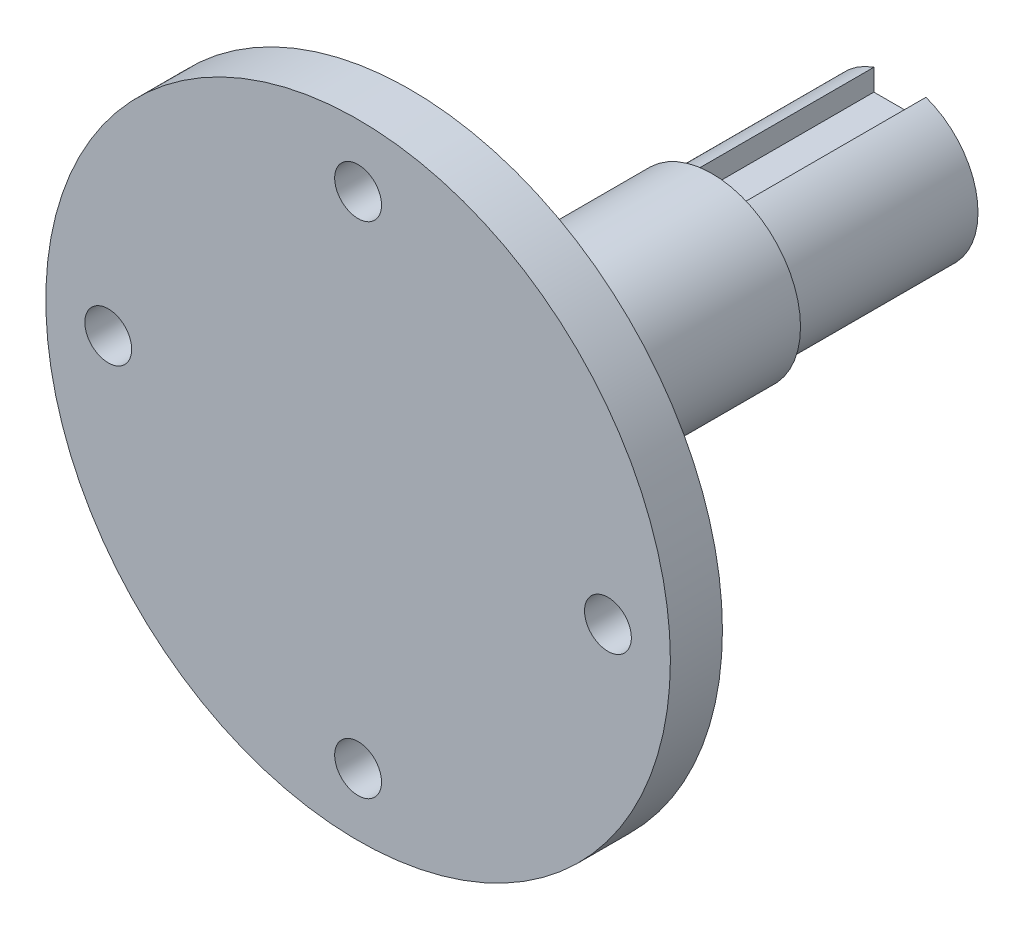
ISO-10303-21;
HEADER;
FILE_DESCRIPTION(('STEP AP214'),'2;1');
FILE_NAME('part.step','',(''),(''),'','','');
FILE_SCHEMA(('AUTOMOTIVE_DESIGN { 1 0 10303 214 1 1 1 1 }'));
ENDSEC;
DATA;
#1=APPLICATION_CONTEXT('core data for automotive mechanical design processes');
#2=APPLICATION_PROTOCOL_DEFINITION('international standard','automotive_design',2000,#1);
#3=PRODUCT_CONTEXT('',#1,'mechanical');
#4=PRODUCT('Part','Part','',(#3));
#5=PRODUCT_RELATED_PRODUCT_CATEGORY('part','',(#4));
#6=PRODUCT_DEFINITION_FORMATION('','',#4);
#7=PRODUCT_DEFINITION_CONTEXT('part definition',#1,'design');
#8=PRODUCT_DEFINITION('design','',#6,#7);
#9=PRODUCT_DEFINITION_SHAPE('','',#8);
#10=(LENGTH_UNIT() NAMED_UNIT(*) SI_UNIT(.MILLI.,.METRE.));
#11=(NAMED_UNIT(*) PLANE_ANGLE_UNIT() SI_UNIT($,.RADIAN.));
#12=(NAMED_UNIT(*) SI_UNIT($,.STERADIAN.) SOLID_ANGLE_UNIT());
#13=UNCERTAINTY_MEASURE_WITH_UNIT(LENGTH_MEASURE(1.E-05),#10,'distance_accuracy_value','');
#14=(GEOMETRIC_REPRESENTATION_CONTEXT(3) GLOBAL_UNCERTAINTY_ASSIGNED_CONTEXT((#13)) GLOBAL_UNIT_ASSIGNED_CONTEXT((#10,
#11,#12)) REPRESENTATION_CONTEXT('',''));
#15=CARTESIAN_POINT('',(0.,0.,0.));
#16=DIRECTION('',(0.,0.,1.));
#17=DIRECTION('',(1.,0.,0.));
#18=AXIS2_PLACEMENT_3D('',#15,#16,#17);
#19=CARTESIAN_POINT('',(0.,0.,20.05));
#20=DIRECTION('',(0.,0.,-1.));
#21=DIRECTION('',(-1.,0.,0.));
#22=AXIS2_PLACEMENT_3D('',#19,#20,#21);
#23=CYLINDRICAL_SURFACE('',#22,7.5);
#24=CARTESIAN_POINT('',(0.,0.,2.));
#25=DIRECTION('',(0.,0.,-1.));
#26=DIRECTION('',(-1.,0.,0.));
#27=AXIS2_PLACEMENT_3D('',#24,#25,#26);
#28=CIRCLE('',#27,7.5);
#29=CARTESIAN_POINT('',(2.5,7.07106781186548,2.));
#30=VERTEX_POINT('',#29);
#31=CARTESIAN_POINT('',(-2.5,7.07106781186548,2.));
#32=VERTEX_POINT('',#31);
#33=EDGE_CURVE('E85',#30,#32,#28,.T.);
#34=ORIENTED_EDGE('',*,*,#33,.F.);
#35=DIRECTION('',(0.,0.,-1.));
#36=VECTOR('',#35,1.);
#37=CARTESIAN_POINT('',(2.5,7.07106781186547,20.05));
#38=LINE('',#37,#36);
#39=CARTESIAN_POINT('',(2.5,7.07106781186548,20.05));
#40=VERTEX_POINT('',#39);
#41=EDGE_CURVE('E177',#30,#40,#38,.F.);
#42=ORIENTED_EDGE('',*,*,#41,.T.);
#43=CARTESIAN_POINT('',(0.,0.,20.05));
#44=DIRECTION('',(0.,0.,1.));
#45=DIRECTION('',(1.,0.,0.));
#46=AXIS2_PLACEMENT_3D('',#43,#44,#45);
#47=CIRCLE('',#46,7.5);
#48=CARTESIAN_POINT('',(-2.5,7.07106781186548,20.05));
#49=VERTEX_POINT('',#48);
#50=EDGE_CURVE('E107',#49,#40,#47,.T.);
#51=ORIENTED_EDGE('',*,*,#50,.F.);
#52=DIRECTION('',(0.,0.,-1.));
#53=VECTOR('',#52,1.);
#54=CARTESIAN_POINT('',(-2.5,7.07106781186548,20.05));
#55=LINE('',#54,#53);
#56=EDGE_CURVE('E100',#49,#32,#55,.T.);
#57=ORIENTED_EDGE('',*,*,#56,.T.);
#58=EDGE_LOOP('',(#34,#42,#51,#57));
#59=FACE_BOUND('',#58,.T.);
#60=ADVANCED_FACE('F42',(#59),#23,.T.);
#61=CARTESIAN_POINT('',(-2.5,5.,21.));
#62=DIRECTION('',(-1.,0.,0.));
#63=DIRECTION('',(0.,0.,1.));
#64=AXIS2_PLACEMENT_3D('',#61,#62,#63);
#65=PLANE('',#64);
#66=DIRECTION('',(0.,-1.,0.));
#67=VECTOR('',#66,1.);
#68=CARTESIAN_POINT('',(-2.5,5.,2.));
#69=LINE('',#68,#67);
#70=CARTESIAN_POINT('',(-2.5,5.,2.00000000000001));
#71=VERTEX_POINT('',#70);
#72=EDGE_CURVE('E60',#32,#71,#69,.T.);
#73=ORIENTED_EDGE('',*,*,#72,.F.);
#74=ORIENTED_EDGE('',*,*,#56,.F.);
#75=DIRECTION('',(0.,-1.,0.));
#76=VECTOR('',#75,1.);
#77=CARTESIAN_POINT('',(-2.5,0.,20.05));
#78=LINE('',#77,#76);
#79=CARTESIAN_POINT('',(-2.5,5.,20.05));
#80=VERTEX_POINT('',#79);
#81=EDGE_CURVE('E109',#49,#80,#78,.T.);
#82=ORIENTED_EDGE('',*,*,#81,.T.);
#83=DIRECTION('',(0.,0.,-1.));
#84=VECTOR('',#83,1.);
#85=CARTESIAN_POINT('',(-2.5,5.,21.));
#86=LINE('',#85,#84);
#87=EDGE_CURVE('E103',#80,#71,#86,.T.);
#88=ORIENTED_EDGE('',*,*,#87,.T.);
#89=EDGE_LOOP('',(#73,#74,#82,#88));
#90=FACE_BOUND('',#89,.T.);
#91=ADVANCED_FACE('F98',(#90),#65,.F.);
#92=CARTESIAN_POINT('',(2.5,5.,21.));
#93=DIRECTION('',(1.,0.,0.));
#94=DIRECTION('',(0.,0.,-1.));
#95=AXIS2_PLACEMENT_3D('',#92,#93,#94);
#96=PLANE('',#95);
#97=DIRECTION('',(0.,1.,0.));
#98=VECTOR('',#97,1.);
#99=CARTESIAN_POINT('',(2.5,5.,2.));
#100=LINE('',#99,#98);
#101=CARTESIAN_POINT('',(2.5,5.,2.));
#102=VERTEX_POINT('',#101);
#103=EDGE_CURVE('E88',#102,#30,#100,.T.);
#104=ORIENTED_EDGE('',*,*,#103,.F.);
#105=DIRECTION('',(0.,0.,-1.));
#106=VECTOR('',#105,1.);
#107=CARTESIAN_POINT('',(2.5,5.,21.));
#108=LINE('',#107,#106);
#109=CARTESIAN_POINT('',(2.5,5.,20.05));
#110=VERTEX_POINT('',#109);
#111=EDGE_CURVE('E171',#110,#102,#108,.T.);
#112=ORIENTED_EDGE('',*,*,#111,.F.);
#113=DIRECTION('',(0.,1.,0.));
#114=VECTOR('',#113,1.);
#115=CARTESIAN_POINT('',(2.5,0.,20.05));
#116=LINE('',#115,#114);
#117=EDGE_CURVE('E68',#110,#40,#116,.T.);
#118=ORIENTED_EDGE('',*,*,#117,.T.);
#119=ORIENTED_EDGE('',*,*,#41,.F.);
#120=EDGE_LOOP('',(#104,#112,#118,#119));
#121=FACE_BOUND('',#120,.T.);
#122=ADVANCED_FACE('F184',(#121),#96,.F.);
#123=CARTESIAN_POINT('',(2.5,5.,21.));
#124=DIRECTION('',(0.,-1.,0.));
#125=DIRECTION('',(0.,0.,-1.));
#126=AXIS2_PLACEMENT_3D('',#123,#124,#125);
#127=PLANE('',#126);
#128=DIRECTION('',(1.,0.,0.));
#129=VECTOR('',#128,1.);
#130=CARTESIAN_POINT('',(2.5,5.,2.));
#131=LINE('',#130,#129);
#132=EDGE_CURVE('E186',#71,#102,#131,.T.);
#133=ORIENTED_EDGE('',*,*,#132,.F.);
#134=ORIENTED_EDGE('',*,*,#87,.F.);
#135=DIRECTION('',(1.,0.,0.));
#136=VECTOR('',#135,1.);
#137=CARTESIAN_POINT('',(0.,5.,20.05));
#138=LINE('',#137,#136);
#139=EDGE_CURVE('E117',#80,#110,#138,.T.);
#140=ORIENTED_EDGE('',*,*,#139,.T.);
#141=ORIENTED_EDGE('',*,*,#111,.T.);
#142=EDGE_LOOP('',(#133,#134,#140,#141));
#143=FACE_BOUND('',#142,.T.);
#144=ADVANCED_FACE('F182',(#143),#127,.F.);
#145=CARTESIAN_POINT('',(0.,0.,44.05));
#146=DIRECTION('',(0.,0.,-1.));
#147=DIRECTION('',(-1.,0.,0.));
#148=AXIS2_PLACEMENT_3D('',#145,#146,#147);
#149=CYLINDRICAL_SURFACE('',#148,8.5);
#150=CARTESIAN_POINT('',(0.,0.,43.45));
#151=DIRECTION('',(0.,0.,1.));
#152=DIRECTION('',(1.,0.,0.));
#153=AXIS2_PLACEMENT_3D('',#150,#151,#152);
#154=CIRCLE('',#153,8.5);
#155=CARTESIAN_POINT('',(8.5,0.,43.45));
#156=VERTEX_POINT('',#155);
#157=EDGE_CURVE('E52',#156,#156,#154,.F.);
#158=ORIENTED_EDGE('',*,*,#157,.T.);
#159=EDGE_LOOP('',(#158));
#160=FACE_BOUND('',#159,.T.);
#161=CARTESIAN_POINT('',(0.,0.,20.05));
#162=DIRECTION('',(0.,0.,1.));
#163=DIRECTION('',(1.,0.,0.));
#164=AXIS2_PLACEMENT_3D('',#161,#162,#163);
#165=CIRCLE('',#164,8.5);
#166=CARTESIAN_POINT('',(8.5,0.,20.05));
#167=VERTEX_POINT('',#166);
#168=EDGE_CURVE('E167',#167,#167,#165,.T.);
#169=ORIENTED_EDGE('',*,*,#168,.T.);
#170=EDGE_LOOP('',(#169));
#171=FACE_BOUND('',#170,.T.);
#172=ADVANCED_FACE('F244',(#160,#171),#149,.T.);
#173=CARTESIAN_POINT('',(0.,0.,20.05));
#174=DIRECTION('',(0.,0.,1.));
#175=DIRECTION('',(1.,0.,0.));
#176=AXIS2_PLACEMENT_3D('',#173,#174,#175);
#177=PLANE('',#176);
#178=ORIENTED_EDGE('',*,*,#81,.F.);
#179=ORIENTED_EDGE('',*,*,#50,.T.);
#180=ORIENTED_EDGE('',*,*,#117,.F.);
#181=ORIENTED_EDGE('',*,*,#139,.F.);
#182=EDGE_LOOP('',(#178,#179,#180,#181));
#183=FACE_BOUND('',#182,.T.);
#184=ORIENTED_EDGE('',*,*,#168,.F.);
#185=EDGE_LOOP('',(#184));
#186=FACE_BOUND('',#185,.T.);
#187=ADVANCED_FACE('F247',(#183,#186),#177,.F.);
#188=CARTESIAN_POINT('',(0.,0.,44.05));
#189=DIRECTION('',(0.,0.,1.));
#190=DIRECTION('',(1.,0.,0.));
#191=AXIS2_PLACEMENT_3D('',#188,#189,#190);
#192=PLANE('',#191);
#193=CARTESIAN_POINT('',(0.,0.,44.05));
#194=DIRECTION('',(0.,0.,1.));
#195=DIRECTION('',(1.,0.,0.));
#196=AXIS2_PLACEMENT_3D('',#193,#194,#195);
#197=CIRCLE('',#196,9.1);
#198=CARTESIAN_POINT('',(9.1,0.,44.05));
#199=VERTEX_POINT('',#198);
#200=EDGE_CURVE('E114',#199,#199,#197,.T.);
#201=ORIENTED_EDGE('',*,*,#200,.T.);
#202=EDGE_LOOP('',(#201));
#203=FACE_BOUND('',#202,.T.);
#204=CARTESIAN_POINT('',(0.,0.,44.05));
#205=DIRECTION('',(0.,0.,1.));
#206=DIRECTION('',(1.,0.,0.));
#207=AXIS2_PLACEMENT_3D('',#204,#205,#206);
#208=CIRCLE('',#207,11.25);
#209=CARTESIAN_POINT('',(11.25,0.,44.05));
#210=VERTEX_POINT('',#209);
#211=EDGE_CURVE('E160',#210,#210,#208,.T.);
#212=ORIENTED_EDGE('',*,*,#211,.F.);
#213=EDGE_LOOP('',(#212));
#214=FACE_BOUND('',#213,.T.);
#215=ADVANCED_FACE('F220',(#203,#214),#192,.F.);
#216=CARTESIAN_POINT('',(0.,0.,54.05));
#217=DIRECTION('',(0.,0.,-1.));
#218=DIRECTION('',(-1.,0.,0.));
#219=AXIS2_PLACEMENT_3D('',#216,#217,#218);
#220=CYLINDRICAL_SURFACE('',#219,30.);
#221=CARTESIAN_POINT('',(0.,0.,54.05));
#222=DIRECTION('',(0.,0.,1.));
#223=DIRECTION('',(1.,0.,0.));
#224=AXIS2_PLACEMENT_3D('',#221,#222,#223);
#225=CIRCLE('',#224,30.);
#226=CARTESIAN_POINT('',(30.,0.,54.05));
#227=VERTEX_POINT('',#226);
#228=EDGE_CURVE('E156',#227,#227,#225,.T.);
#229=ORIENTED_EDGE('',*,*,#228,.F.);
#230=EDGE_LOOP('',(#229));
#231=FACE_BOUND('',#230,.T.);
#232=CARTESIAN_POINT('',(0.,0.,49.05));
#233=DIRECTION('',(0.,0.,1.));
#234=DIRECTION('',(1.,0.,0.));
#235=AXIS2_PLACEMENT_3D('',#232,#233,#234);
#236=CIRCLE('',#235,30.);
#237=CARTESIAN_POINT('',(30.,0.,49.05));
#238=VERTEX_POINT('',#237);
#239=EDGE_CURVE('E155',#238,#238,#236,.T.);
#240=ORIENTED_EDGE('',*,*,#239,.T.);
#241=EDGE_LOOP('',(#240));
#242=FACE_BOUND('',#241,.T.);
#243=ADVANCED_FACE('F210',(#231,#242),#220,.T.);
#244=CARTESIAN_POINT('',(0.,0.,54.05));
#245=DIRECTION('',(0.,0.,1.));
#246=DIRECTION('',(1.,0.,0.));
#247=AXIS2_PLACEMENT_3D('',#244,#245,#246);
#248=PLANE('',#247);
#249=CARTESIAN_POINT('',(0.,24.,54.05));
#250=DIRECTION('',(0.,0.,1.));
#251=DIRECTION('',(1.,0.,0.));
#252=AXIS2_PLACEMENT_3D('',#249,#250,#251);
#253=CIRCLE('',#252,2.24999999999999);
#254=CARTESIAN_POINT('',(2.24999999999999,24.,54.05));
#255=VERTEX_POINT('',#254);
#256=EDGE_CURVE('E193',#255,#255,#253,.T.);
#257=ORIENTED_EDGE('',*,*,#256,.F.);
#258=EDGE_LOOP('',(#257));
#259=FACE_BOUND('',#258,.T.);
#260=CARTESIAN_POINT('',(0.,-24.,54.05));
#261=DIRECTION('',(0.,0.,1.));
#262=DIRECTION('',(1.,0.,0.));
#263=AXIS2_PLACEMENT_3D('',#260,#261,#262);
#264=CIRCLE('',#263,2.24999999999999);
#265=CARTESIAN_POINT('',(2.24999999999999,-24.,54.05));
#266=VERTEX_POINT('',#265);
#267=EDGE_CURVE('E148',#266,#266,#264,.T.);
#268=ORIENTED_EDGE('',*,*,#267,.F.);
#269=EDGE_LOOP('',(#268));
#270=FACE_BOUND('',#269,.T.);
#271=CARTESIAN_POINT('',(24.,0.,54.05));
#272=DIRECTION('',(0.,0.,1.));
#273=DIRECTION('',(1.,0.,0.));
#274=AXIS2_PLACEMENT_3D('',#271,#272,#273);
#275=CIRCLE('',#274,2.25);
#276=CARTESIAN_POINT('',(26.25,0.,54.05));
#277=VERTEX_POINT('',#276);
#278=EDGE_CURVE('E130',#277,#277,#275,.T.);
#279=ORIENTED_EDGE('',*,*,#278,.F.);
#280=EDGE_LOOP('',(#279));
#281=FACE_BOUND('',#280,.T.);
#282=CARTESIAN_POINT('',(-24.,0.,54.05));
#283=DIRECTION('',(0.,0.,1.));
#284=DIRECTION('',(1.,0.,0.));
#285=AXIS2_PLACEMENT_3D('',#282,#283,#284);
#286=CIRCLE('',#285,2.25);
#287=CARTESIAN_POINT('',(-21.75,0.,54.05));
#288=VERTEX_POINT('',#287);
#289=EDGE_CURVE('E129',#288,#288,#286,.T.);
#290=ORIENTED_EDGE('',*,*,#289,.F.);
#291=EDGE_LOOP('',(#290));
#292=FACE_BOUND('',#291,.T.);
#293=ORIENTED_EDGE('',*,*,#228,.T.);
#294=EDGE_LOOP('',(#293));
#295=FACE_BOUND('',#294,.T.);
#296=ADVANCED_FACE('F206',(#259,#270,#281,#292,#295),#248,.T.);
#297=CARTESIAN_POINT('',(0.,0.,49.05));
#298=DIRECTION('',(0.,0.,1.));
#299=DIRECTION('',(1.,0.,0.));
#300=AXIS2_PLACEMENT_3D('',#297,#298,#299);
#301=PLANE('',#300);
#302=CARTESIAN_POINT('',(0.,24.,49.05));
#303=DIRECTION('',(0.,0.,1.));
#304=DIRECTION('',(1.,0.,0.));
#305=AXIS2_PLACEMENT_3D('',#302,#303,#304);
#306=CIRCLE('',#305,2.24999999999999);
#307=CARTESIAN_POINT('',(2.24999999999999,24.,49.05));
#308=VERTEX_POINT('',#307);
#309=EDGE_CURVE('E197',#308,#308,#306,.T.);
#310=ORIENTED_EDGE('',*,*,#309,.T.);
#311=EDGE_LOOP('',(#310));
#312=FACE_BOUND('',#311,.T.);
#313=CARTESIAN_POINT('',(0.,-24.,49.05));
#314=DIRECTION('',(0.,0.,1.));
#315=DIRECTION('',(1.,0.,0.));
#316=AXIS2_PLACEMENT_3D('',#313,#314,#315);
#317=CIRCLE('',#316,2.24999999999999);
#318=CARTESIAN_POINT('',(2.24999999999999,-24.,49.05));
#319=VERTEX_POINT('',#318);
#320=EDGE_CURVE('E141',#319,#319,#317,.T.);
#321=ORIENTED_EDGE('',*,*,#320,.T.);
#322=EDGE_LOOP('',(#321));
#323=FACE_BOUND('',#322,.T.);
#324=CARTESIAN_POINT('',(24.,0.,49.05));
#325=DIRECTION('',(0.,0.,1.));
#326=DIRECTION('',(1.,0.,0.));
#327=AXIS2_PLACEMENT_3D('',#324,#325,#326);
#328=CIRCLE('',#327,2.24999999999999);
#329=CARTESIAN_POINT('',(26.25,0.,49.05));
#330=VERTEX_POINT('',#329);
#331=EDGE_CURVE('E126',#330,#330,#328,.T.);
#332=ORIENTED_EDGE('',*,*,#331,.T.);
#333=EDGE_LOOP('',(#332));
#334=FACE_BOUND('',#333,.T.);
#335=CARTESIAN_POINT('',(-24.,0.,49.05));
#336=DIRECTION('',(0.,0.,1.));
#337=DIRECTION('',(1.,0.,0.));
#338=AXIS2_PLACEMENT_3D('',#335,#336,#337);
#339=CIRCLE('',#338,2.24999999999999);
#340=CARTESIAN_POINT('',(-21.75,0.,49.05));
#341=VERTEX_POINT('',#340);
#342=EDGE_CURVE('E137',#341,#341,#339,.T.);
#343=ORIENTED_EDGE('',*,*,#342,.T.);
#344=EDGE_LOOP('',(#343));
#345=FACE_BOUND('',#344,.T.);
#346=CARTESIAN_POINT('',(0.,0.,49.05));
#347=DIRECTION('',(0.,0.,1.));
#348=DIRECTION('',(1.,0.,0.));
#349=AXIS2_PLACEMENT_3D('',#346,#347,#348);
#350=CIRCLE('',#349,16.25);
#351=CARTESIAN_POINT('',(16.25,0.,49.05));
#352=VERTEX_POINT('',#351);
#353=EDGE_CURVE('E11',#352,#352,#350,.T.);
#354=ORIENTED_EDGE('',*,*,#353,.T.);
#355=EDGE_LOOP('',(#354));
#356=FACE_BOUND('',#355,.T.);
#357=ORIENTED_EDGE('',*,*,#239,.F.);
#358=EDGE_LOOP('',(#357));
#359=FACE_BOUND('',#358,.T.);
#360=ADVANCED_FACE('F209',(#312,#323,#334,#345,#356,#359),#301,.F.);
#361=CARTESIAN_POINT('',(0.,0.,43.45));
#362=DIRECTION('',(0.,0.,1.));
#363=DIRECTION('',(1.,0.,0.));
#364=AXIS2_PLACEMENT_3D('',#361,#362,#363);
#365=TOROIDAL_SURFACE('',#364,9.1,0.6);
#366=ORIENTED_EDGE('',*,*,#157,.F.);
#367=EDGE_LOOP('',(#366));
#368=FACE_BOUND('',#367,.T.);
#369=ORIENTED_EDGE('',*,*,#200,.F.);
#370=EDGE_LOOP('',(#369));
#371=FACE_BOUND('',#370,.T.);
#372=ADVANCED_FACE('F225',(#368,#371),#365,.F.);
#373=CARTESIAN_POINT('',(0.,0.,44.05));
#374=DIRECTION('',(0.,0.,1.));
#375=DIRECTION('',(1.,0.,0.));
#376=AXIS2_PLACEMENT_3D('',#373,#374,#375);
#377=TOROIDAL_SURFACE('',#376,16.25,5.);
#378=ORIENTED_EDGE('',*,*,#211,.T.);
#379=EDGE_LOOP('',(#378));
#380=FACE_BOUND('',#379,.T.);
#381=ORIENTED_EDGE('',*,*,#353,.F.);
#382=EDGE_LOOP('',(#381));
#383=FACE_BOUND('',#382,.T.);
#384=ADVANCED_FACE('F44',(#380,#383),#377,.F.);
#385=CARTESIAN_POINT('',(-24.,0.,54.05));
#386=DIRECTION('',(0.,0.,1.));
#387=DIRECTION('',(1.,0.,0.));
#388=AXIS2_PLACEMENT_3D('',#385,#386,#387);
#389=CYLINDRICAL_SURFACE('',#388,2.24999999999999);
#390=ORIENTED_EDGE('',*,*,#289,.T.);
#391=EDGE_LOOP('',(#390));
#392=FACE_BOUND('',#391,.T.);
#393=ORIENTED_EDGE('',*,*,#342,.F.);
#394=EDGE_LOOP('',(#393));
#395=FACE_BOUND('',#394,.T.);
#396=ADVANCED_FACE('F261',(#392,#395),#389,.F.);
#397=CARTESIAN_POINT('',(24.,0.,54.05));
#398=DIRECTION('',(0.,0.,1.));
#399=DIRECTION('',(1.,0.,0.));
#400=AXIS2_PLACEMENT_3D('',#397,#398,#399);
#401=CYLINDRICAL_SURFACE('',#400,2.24999999999999);
#402=ORIENTED_EDGE('',*,*,#278,.T.);
#403=EDGE_LOOP('',(#402));
#404=FACE_BOUND('',#403,.T.);
#405=ORIENTED_EDGE('',*,*,#331,.F.);
#406=EDGE_LOOP('',(#405));
#407=FACE_BOUND('',#406,.T.);
#408=ADVANCED_FACE('F267',(#404,#407),#401,.F.);
#409=CARTESIAN_POINT('',(0.,-24.,54.05));
#410=DIRECTION('',(0.,0.,1.));
#411=DIRECTION('',(1.,0.,0.));
#412=AXIS2_PLACEMENT_3D('',#409,#410,#411);
#413=CYLINDRICAL_SURFACE('',#412,2.24999999999999);
#414=ORIENTED_EDGE('',*,*,#267,.T.);
#415=EDGE_LOOP('',(#414));
#416=FACE_BOUND('',#415,.T.);
#417=ORIENTED_EDGE('',*,*,#320,.F.);
#418=EDGE_LOOP('',(#417));
#419=FACE_BOUND('',#418,.T.);
#420=ADVANCED_FACE('F203',(#416,#419),#413,.F.);
#421=CARTESIAN_POINT('',(0.,24.,54.05));
#422=DIRECTION('',(0.,0.,1.));
#423=DIRECTION('',(1.,0.,0.));
#424=AXIS2_PLACEMENT_3D('',#421,#422,#423);
#425=CYLINDRICAL_SURFACE('',#424,2.24999999999999);
#426=ORIENTED_EDGE('',*,*,#256,.T.);
#427=EDGE_LOOP('',(#426));
#428=FACE_BOUND('',#427,.T.);
#429=ORIENTED_EDGE('',*,*,#309,.F.);
#430=EDGE_LOOP('',(#429));
#431=FACE_BOUND('',#430,.T.);
#432=ADVANCED_FACE('F278',(#428,#431),#425,.F.);
#433=CARTESIAN_POINT('',(0.,0.,2.));
#434=DIRECTION('',(0.,0.,-1.));
#435=DIRECTION('',(-1.,0.,0.));
#436=AXIS2_PLACEMENT_3D('',#433,#434,#435);
#437=PLANE('',#436);
#438=CARTESIAN_POINT('',(0.,0.,2.));
#439=DIRECTION('',(0.,0.,-1.));
#440=DIRECTION('',(-1.,0.,0.));
#441=AXIS2_PLACEMENT_3D('',#438,#439,#440);
#442=CIRCLE('',#441,4.1275);
#443=CARTESIAN_POINT('',(-4.1275,0.,2.));
#444=VERTEX_POINT('',#443);
#445=EDGE_CURVE('E46',#444,#444,#442,.F.);
#446=ORIENTED_EDGE('',*,*,#445,.T.);
#447=EDGE_LOOP('',(#446));
#448=FACE_BOUND('',#447,.T.);
#449=ORIENTED_EDGE('',*,*,#72,.T.);
#450=ORIENTED_EDGE('',*,*,#132,.T.);
#451=ORIENTED_EDGE('',*,*,#103,.T.);
#452=ORIENTED_EDGE('',*,*,#33,.T.);
#453=EDGE_LOOP('',(#449,#450,#451,#452));
#454=FACE_BOUND('',#453,.T.);
#455=ADVANCED_FACE('F86',(#448,#454),#437,.T.);
#456=CARTESIAN_POINT('',(0.,0.,8.));
#457=DIRECTION('',(0.,0.,1.));
#458=DIRECTION('',(1.,0.,0.));
#459=AXIS2_PLACEMENT_3D('',#456,#457,#458);
#460=PLANE('',#459);
#461=CARTESIAN_POINT('',(0.,0.,8.));
#462=DIRECTION('',(0.,0.,-1.));
#463=DIRECTION('',(-1.,0.,0.));
#464=AXIS2_PLACEMENT_3D('',#461,#462,#463);
#465=CIRCLE('',#464,3.3);
#466=CARTESIAN_POINT('',(-3.3,0.,8.));
#467=VERTEX_POINT('',#466);
#468=EDGE_CURVE('E307',#467,#467,#465,.T.);
#469=ORIENTED_EDGE('',*,*,#468,.F.);
#470=EDGE_LOOP('',(#469));
#471=FACE_BOUND('',#470,.T.);
#472=CARTESIAN_POINT('',(0.,0.,8.));
#473=DIRECTION('',(0.,0.,-1.));
#474=DIRECTION('',(-1.,0.,0.));
#475=AXIS2_PLACEMENT_3D('',#472,#473,#474);
#476=CIRCLE('',#475,4.1275);
#477=CARTESIAN_POINT('',(-4.1275,0.,8.));
#478=VERTEX_POINT('',#477);
#479=EDGE_CURVE('E105',#478,#478,#476,.T.);
#480=ORIENTED_EDGE('',*,*,#479,.T.);
#481=EDGE_LOOP('',(#480));
#482=FACE_BOUND('',#481,.T.);
#483=ADVANCED_FACE('F282',(#471,#482),#460,.F.);
#484=CARTESIAN_POINT('',(0.,0.,0.));
#485=DIRECTION('',(0.,0.,-1.));
#486=DIRECTION('',(-1.,0.,0.));
#487=AXIS2_PLACEMENT_3D('',#484,#485,#486);
#488=CYLINDRICAL_SURFACE('',#487,4.1275);
#489=ORIENTED_EDGE('',*,*,#479,.F.);
#490=EDGE_LOOP('',(#489));
#491=FACE_BOUND('',#490,.T.);
#492=ORIENTED_EDGE('',*,*,#445,.F.);
#493=EDGE_LOOP('',(#492));
#494=FACE_BOUND('',#493,.T.);
#495=ADVANCED_FACE('F285',(#491,#494),#488,.F.);
#496=CARTESIAN_POINT('',(0.,0.,20.));
#497=DIRECTION('',(0.,0.,1.));
#498=DIRECTION('',(1.,0.,0.));
#499=AXIS2_PLACEMENT_3D('',#496,#497,#498);
#500=PLANE('',#499);
#501=CARTESIAN_POINT('',(0.,0.,20.));
#502=DIRECTION('',(0.,0.,-1.));
#503=DIRECTION('',(-1.,0.,0.));
#504=AXIS2_PLACEMENT_3D('',#501,#502,#503);
#505=CIRCLE('',#504,3.3);
#506=CARTESIAN_POINT('',(-3.3,0.,20.));
#507=VERTEX_POINT('',#506);
#508=EDGE_CURVE('E93',#507,#507,#505,.T.);
#509=ORIENTED_EDGE('',*,*,#508,.T.);
#510=EDGE_LOOP('',(#509));
#511=FACE_BOUND('',#510,.T.);
#512=ADVANCED_FACE('F289',(#511),#500,.F.);
#513=CARTESIAN_POINT('',(0.,0.,8.));
#514=DIRECTION('',(0.,0.,-1.));
#515=DIRECTION('',(-1.,0.,0.));
#516=AXIS2_PLACEMENT_3D('',#513,#514,#515);
#517=CYLINDRICAL_SURFACE('',#516,3.3);
#518=ORIENTED_EDGE('',*,*,#508,.F.);
#519=EDGE_LOOP('',(#518));
#520=FACE_BOUND('',#519,.T.);
#521=ORIENTED_EDGE('',*,*,#468,.T.);
#522=EDGE_LOOP('',(#521));
#523=FACE_BOUND('',#522,.T.);
#524=ADVANCED_FACE('F296',(#520,#523),#517,.F.);
#525=CLOSED_SHELL('',(#60,#91,#122,#144,#172,#187,#215,#243,#296,#360,#372,#384,#396,#408,#420,
#432,#455,#483,#495,#512,#524));
#526=MANIFOLD_SOLID_BREP('B2',#525);
#527=ADVANCED_BREP_SHAPE_REPRESENTATION('',(#18,#526),#14);
#528=SHAPE_DEFINITION_REPRESENTATION(#9,#527);
ENDSEC;
END-ISO-10303-21;
